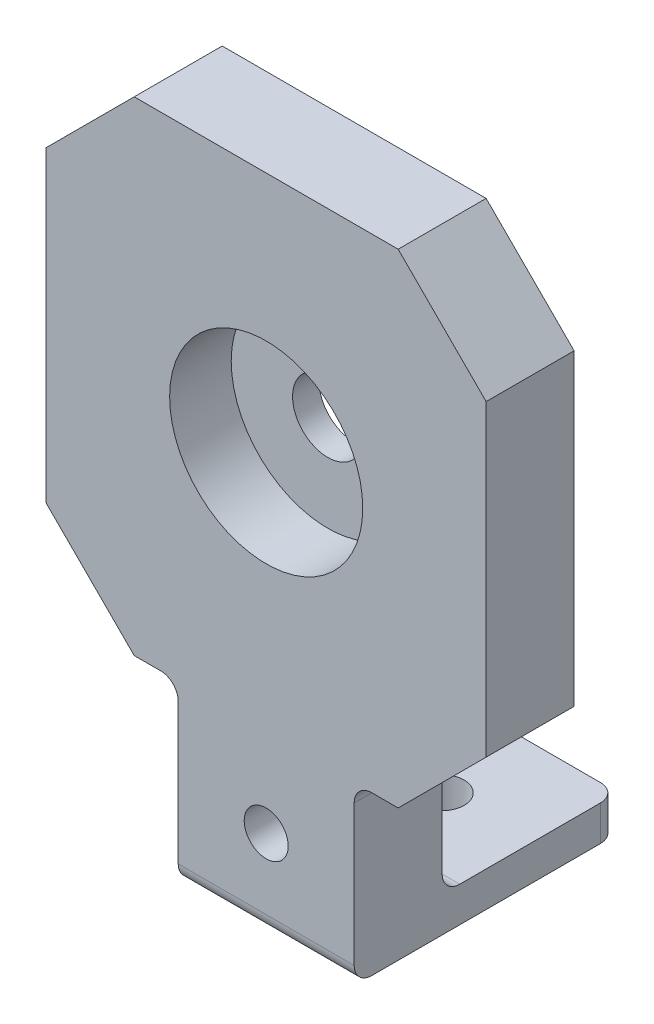
ISO-10303-21;
HEADER;
FILE_DESCRIPTION(('STEP AP214'),'2;1');
FILE_NAME('part.step','',(''),(''),'','','');
FILE_SCHEMA(('AUTOMOTIVE_DESIGN { 1 0 10303 214 1 1 1 1 }'));
ENDSEC;
DATA;
#1=APPLICATION_CONTEXT('core data for automotive mechanical design processes');
#2=APPLICATION_PROTOCOL_DEFINITION('international standard','automotive_design',2000,#1);
#3=PRODUCT_CONTEXT('',#1,'mechanical');
#4=PRODUCT('Part','Part','',(#3));
#5=PRODUCT_RELATED_PRODUCT_CATEGORY('part','',(#4));
#6=PRODUCT_DEFINITION_FORMATION('','',#4);
#7=PRODUCT_DEFINITION_CONTEXT('part definition',#1,'design');
#8=PRODUCT_DEFINITION('design','',#6,#7);
#9=PRODUCT_DEFINITION_SHAPE('','',#8);
#10=(LENGTH_UNIT() NAMED_UNIT(*) SI_UNIT(.MILLI.,.METRE.));
#11=(NAMED_UNIT(*) PLANE_ANGLE_UNIT() SI_UNIT($,.RADIAN.));
#12=(NAMED_UNIT(*) SI_UNIT($,.STERADIAN.) SOLID_ANGLE_UNIT());
#13=UNCERTAINTY_MEASURE_WITH_UNIT(LENGTH_MEASURE(1.E-05),#10,'distance_accuracy_value','');
#14=(GEOMETRIC_REPRESENTATION_CONTEXT(3) GLOBAL_UNCERTAINTY_ASSIGNED_CONTEXT((#13)) GLOBAL_UNIT_ASSIGNED_CONTEXT((#10,
#11,#12)) REPRESENTATION_CONTEXT('',''));
#15=CARTESIAN_POINT('',(0.,0.,0.));
#16=DIRECTION('',(0.,0.,1.));
#17=DIRECTION('',(1.,0.,0.));
#18=AXIS2_PLACEMENT_3D('',#15,#16,#17);
#19=CARTESIAN_POINT('',(0.,47.5,10.));
#20=DIRECTION('',(0.,0.,-1.));
#21=DIRECTION('',(-1.,0.,0.));
#22=AXIS2_PLACEMENT_3D('',#19,#20,#21);
#23=CYLINDRICAL_SURFACE('',#22,4.);
#24=CARTESIAN_POINT('',(0.,47.5,0.));
#25=DIRECTION('',(0.,0.,1.));
#26=DIRECTION('',(1.,0.,0.));
#27=AXIS2_PLACEMENT_3D('',#24,#25,#26);
#28=CIRCLE('',#27,4.);
#29=CARTESIAN_POINT('',(4.00000000000001,47.5,0.));
#30=VERTEX_POINT('',#29);
#31=EDGE_CURVE('E254',#30,#30,#28,.T.);
#32=ORIENTED_EDGE('',*,*,#31,.F.);
#33=EDGE_LOOP('',(#32));
#34=FACE_BOUND('',#33,.T.);
#35=CARTESIAN_POINT('',(0.,47.5,3.));
#36=DIRECTION('',(0.,0.,1.));
#37=DIRECTION('',(1.,0.,0.));
#38=AXIS2_PLACEMENT_3D('',#35,#36,#37);
#39=CIRCLE('',#38,4.);
#40=CARTESIAN_POINT('',(4.00000000000001,47.5,3.));
#41=VERTEX_POINT('',#40);
#42=EDGE_CURVE('E251',#41,#41,#39,.T.);
#43=ORIENTED_EDGE('',*,*,#42,.T.);
#44=EDGE_LOOP('',(#43));
#45=FACE_BOUND('',#44,.T.);
#46=ADVANCED_FACE('F35',(#34,#45),#23,.F.);
#47=CARTESIAN_POINT('',(0.,0.,10.));
#48=DIRECTION('',(0.,0.,-1.));
#49=DIRECTION('',(-1.,0.,0.));
#50=AXIS2_PLACEMENT_3D('',#47,#48,#49);
#51=PLANE('',#50);
#52=CARTESIAN_POINT('',(0.,10.,10.));
#53=DIRECTION('',(0.,0.,-1.));
#54=DIRECTION('',(-1.,0.,0.));
#55=AXIS2_PLACEMENT_3D('',#52,#53,#54);
#56=CIRCLE('',#55,2.5);
#57=CARTESIAN_POINT('',(-2.5,10.,10.));
#58=VERTEX_POINT('',#57);
#59=EDGE_CURVE('E614',#58,#58,#56,.T.);
#60=ORIENTED_EDGE('',*,*,#59,.T.);
#61=EDGE_LOOP('',(#60));
#62=FACE_BOUND('',#61,.T.);
#63=CARTESIAN_POINT('',(0.,47.5,10.));
#64=DIRECTION('',(0.,0.,1.));
#65=DIRECTION('',(1.,0.,0.));
#66=AXIS2_PLACEMENT_3D('',#63,#64,#65);
#67=CIRCLE('',#66,10.975);
#68=CARTESIAN_POINT('',(10.975,47.5,10.));
#69=VERTEX_POINT('',#68);
#70=EDGE_CURVE('E332',#69,#69,#67,.T.);
#71=ORIENTED_EDGE('',*,*,#70,.F.);
#72=EDGE_LOOP('',(#71));
#73=FACE_BOUND('',#72,.T.);
#74=DIRECTION('',(0.,-1.,0.));
#75=VECTOR('',#74,1.);
#76=CARTESIAN_POINT('',(-10.,0.,10.));
#77=LINE('',#76,#75);
#78=CARTESIAN_POINT('',(-10.,18.,10.));
#79=VERTEX_POINT('',#78);
#80=CARTESIAN_POINT('',(-10.,2.,10.));
#81=VERTEX_POINT('',#80);
#82=EDGE_CURVE('E320',#79,#81,#77,.T.);
#83=ORIENTED_EDGE('',*,*,#82,.T.);
#84=DIRECTION('',(1.,0.,0.));
#85=VECTOR('',#84,1.);
#86=CARTESIAN_POINT('',(0.,2.,10.));
#87=LINE('',#86,#85);
#88=CARTESIAN_POINT('',(10.,2.,10.));
#89=VERTEX_POINT('',#88);
#90=EDGE_CURVE('E287',#81,#89,#87,.T.);
#91=ORIENTED_EDGE('',*,*,#90,.T.);
#92=DIRECTION('',(0.,1.,0.));
#93=VECTOR('',#92,1.);
#94=CARTESIAN_POINT('',(10.,0.,10.));
#95=LINE('',#94,#93);
#96=CARTESIAN_POINT('',(10.,18.,10.));
#97=VERTEX_POINT('',#96);
#98=EDGE_CURVE('E314',#89,#97,#95,.T.);
#99=ORIENTED_EDGE('',*,*,#98,.T.);
#100=CARTESIAN_POINT('',(12.,18.,10.));
#101=DIRECTION('',(0.,0.,-1.));
#102=DIRECTION('',(-1.,0.,0.));
#103=AXIS2_PLACEMENT_3D('',#100,#101,#102);
#104=CIRCLE('',#103,2.);
#105=CARTESIAN_POINT('',(12.,20.,10.));
#106=VERTEX_POINT('',#105);
#107=EDGE_CURVE('E11',#97,#106,#104,.T.);
#108=ORIENTED_EDGE('',*,*,#107,.T.);
#109=DIRECTION('',(1.,0.,0.));
#110=VECTOR('',#109,1.);
#111=CARTESIAN_POINT('',(10.,20.,10.));
#112=LINE('',#111,#110);
#113=CARTESIAN_POINT('',(15.,20.,10.));
#114=VERTEX_POINT('',#113);
#115=EDGE_CURVE('E219',#106,#114,#112,.T.);
#116=ORIENTED_EDGE('',*,*,#115,.T.);
#117=DIRECTION('',(-0.707106781186549,-0.707106781186546,0.));
#118=VECTOR('',#117,1.);
#119=CARTESIAN_POINT('',(25.,30.,10.));
#120=LINE('',#119,#118);
#121=CARTESIAN_POINT('',(25.,30.,10.));
#122=VERTEX_POINT('',#121);
#123=EDGE_CURVE('E233',#114,#122,#120,.F.);
#124=ORIENTED_EDGE('',*,*,#123,.T.);
#125=DIRECTION('',(0.,1.,0.));
#126=VECTOR('',#125,1.);
#127=CARTESIAN_POINT('',(25.,20.,10.));
#128=LINE('',#127,#126);
#129=CARTESIAN_POINT('',(25.,65.,10.));
#130=VERTEX_POINT('',#129);
#131=EDGE_CURVE('E214',#122,#130,#128,.T.);
#132=ORIENTED_EDGE('',*,*,#131,.T.);
#133=DIRECTION('',(0.707106781186547,-0.707106781186549,0.));
#134=VECTOR('',#133,1.);
#135=CARTESIAN_POINT('',(15.,75.,10.));
#136=LINE('',#135,#134);
#137=CARTESIAN_POINT('',(15.,75.,10.));
#138=VERTEX_POINT('',#137);
#139=EDGE_CURVE('E231',#130,#138,#136,.F.);
#140=ORIENTED_EDGE('',*,*,#139,.T.);
#141=DIRECTION('',(-1.,0.,0.));
#142=VECTOR('',#141,1.);
#143=CARTESIAN_POINT('',(-25.,75.,10.));
#144=LINE('',#143,#142);
#145=CARTESIAN_POINT('',(-15.,75.,10.));
#146=VERTEX_POINT('',#145);
#147=EDGE_CURVE('E336',#138,#146,#144,.T.);
#148=ORIENTED_EDGE('',*,*,#147,.T.);
#149=DIRECTION('',(0.70710678118655,0.707106781186546,0.));
#150=VECTOR('',#149,1.);
#151=CARTESIAN_POINT('',(-25.,65.,10.));
#152=LINE('',#151,#150);
#153=CARTESIAN_POINT('',(-25.,65.,10.));
#154=VERTEX_POINT('',#153);
#155=EDGE_CURVE('E237',#146,#154,#152,.F.);
#156=ORIENTED_EDGE('',*,*,#155,.T.);
#157=DIRECTION('',(0.,-1.,0.));
#158=VECTOR('',#157,1.);
#159=CARTESIAN_POINT('',(-25.,20.,10.));
#160=LINE('',#159,#158);
#161=CARTESIAN_POINT('',(-25.,30.,10.));
#162=VERTEX_POINT('',#161);
#163=EDGE_CURVE('E191',#154,#162,#160,.T.);
#164=ORIENTED_EDGE('',*,*,#163,.T.);
#165=DIRECTION('',(-0.707106781186546,0.707106781186549,0.));
#166=VECTOR('',#165,1.);
#167=CARTESIAN_POINT('',(-15.,20.,10.));
#168=LINE('',#167,#166);
#169=CARTESIAN_POINT('',(-15.,20.,10.));
#170=VERTEX_POINT('',#169);
#171=EDGE_CURVE('E235',#162,#170,#168,.F.);
#172=ORIENTED_EDGE('',*,*,#171,.T.);
#173=DIRECTION('',(1.,0.,0.));
#174=VECTOR('',#173,1.);
#175=CARTESIAN_POINT('',(-25.,20.,10.));
#176=LINE('',#175,#174);
#177=CARTESIAN_POINT('',(-12.,20.,10.));
#178=VERTEX_POINT('',#177);
#179=EDGE_CURVE('E340',#170,#178,#176,.T.);
#180=ORIENTED_EDGE('',*,*,#179,.T.);
#181=CARTESIAN_POINT('',(-12.,18.,10.));
#182=DIRECTION('',(0.,0.,-1.));
#183=DIRECTION('',(-1.,0.,0.));
#184=AXIS2_PLACEMENT_3D('',#181,#182,#183);
#185=CIRCLE('',#184,2.);
#186=EDGE_CURVE('E301',#178,#79,#185,.T.);
#187=ORIENTED_EDGE('',*,*,#186,.T.);
#188=EDGE_LOOP('',(#83,#91,#99,#108,#116,#124,#132,#140,#148,#156,#164,#172,#180,#187));
#189=FACE_BOUND('',#188,.T.);
#190=ADVANCED_FACE('F313',(#62,#73,#189),#51,.F.);
#191=CARTESIAN_POINT('',(0.,0.,0.));
#192=DIRECTION('',(0.,0.,-1.));
#193=DIRECTION('',(-1.,0.,0.));
#194=AXIS2_PLACEMENT_3D('',#191,#192,#193);
#195=PLANE('',#194);
#196=CARTESIAN_POINT('',(0.,10.,0.));
#197=DIRECTION('',(0.,0.,-1.));
#198=DIRECTION('',(-1.,0.,0.));
#199=AXIS2_PLACEMENT_3D('',#196,#197,#198);
#200=CIRCLE('',#199,2.5);
#201=CARTESIAN_POINT('',(-2.5,10.,0.));
#202=VERTEX_POINT('',#201);
#203=EDGE_CURVE('E617',#202,#202,#200,.T.);
#204=ORIENTED_EDGE('',*,*,#203,.F.);
#205=EDGE_LOOP('',(#204));
#206=FACE_BOUND('',#205,.T.);
#207=DIRECTION('',(0.,1.,0.));
#208=VECTOR('',#207,1.);
#209=CARTESIAN_POINT('',(10.,0.,0.));
#210=LINE('',#209,#208);
#211=CARTESIAN_POINT('',(10.,6.,0.));
#212=VERTEX_POINT('',#211);
#213=CARTESIAN_POINT('',(10.,18.,0.));
#214=VERTEX_POINT('',#213);
#215=EDGE_CURVE('E209',#212,#214,#210,.T.);
#216=ORIENTED_EDGE('',*,*,#215,.F.);
#217=DIRECTION('',(1.,0.,0.));
#218=VECTOR('',#217,1.);
#219=CARTESIAN_POINT('',(0.,6.,0.));
#220=LINE('',#219,#218);
#221=CARTESIAN_POINT('',(-10.,6.,0.));
#222=VERTEX_POINT('',#221);
#223=EDGE_CURVE('E290',#212,#222,#220,.F.);
#224=ORIENTED_EDGE('',*,*,#223,.T.);
#225=DIRECTION('',(0.,-1.,0.));
#226=VECTOR('',#225,1.);
#227=CARTESIAN_POINT('',(-10.,0.,0.));
#228=LINE('',#227,#226);
#229=CARTESIAN_POINT('',(-10.,18.,0.));
#230=VERTEX_POINT('',#229);
#231=EDGE_CURVE('E201',#230,#222,#228,.T.);
#232=ORIENTED_EDGE('',*,*,#231,.F.);
#233=CARTESIAN_POINT('',(-12.,18.,0.));
#234=DIRECTION('',(0.,0.,-1.));
#235=DIRECTION('',(-1.,0.,0.));
#236=AXIS2_PLACEMENT_3D('',#233,#234,#235);
#237=CIRCLE('',#236,2.);
#238=CARTESIAN_POINT('',(-12.,20.,0.));
#239=VERTEX_POINT('',#238);
#240=EDGE_CURVE('E57',#230,#239,#237,.F.);
#241=ORIENTED_EDGE('',*,*,#240,.T.);
#242=DIRECTION('',(1.,0.,0.));
#243=VECTOR('',#242,1.);
#244=CARTESIAN_POINT('',(-25.,20.,0.));
#245=LINE('',#244,#243);
#246=CARTESIAN_POINT('',(-15.,20.,0.));
#247=VERTEX_POINT('',#246);
#248=EDGE_CURVE('E198',#247,#239,#245,.T.);
#249=ORIENTED_EDGE('',*,*,#248,.F.);
#250=DIRECTION('',(0.707106781186546,-0.707106781186549,0.));
#251=VECTOR('',#250,1.);
#252=CARTESIAN_POINT('',(2.49999999999996,2.49999999999995,0.));
#253=LINE('',#252,#251);
#254=CARTESIAN_POINT('',(-25.,30.,0.));
#255=VERTEX_POINT('',#254);
#256=EDGE_CURVE('E182',#247,#255,#253,.F.);
#257=ORIENTED_EDGE('',*,*,#256,.T.);
#258=DIRECTION('',(0.,-1.,0.));
#259=VECTOR('',#258,1.);
#260=CARTESIAN_POINT('',(-25.,20.,0.));
#261=LINE('',#260,#259);
#262=CARTESIAN_POINT('',(-25.,65.,0.));
#263=VERTEX_POINT('',#262);
#264=EDGE_CURVE('E188',#263,#255,#261,.T.);
#265=ORIENTED_EDGE('',*,*,#264,.F.);
#266=DIRECTION('',(-0.70710678118655,-0.707106781186546,0.));
#267=VECTOR('',#266,1.);
#268=CARTESIAN_POINT('',(-44.9999999999999,45.0000000000002,0.));
#269=LINE('',#268,#267);
#270=CARTESIAN_POINT('',(-15.,75.,0.));
#271=VERTEX_POINT('',#270);
#272=EDGE_CURVE('E172',#263,#271,#269,.F.);
#273=ORIENTED_EDGE('',*,*,#272,.T.);
#274=DIRECTION('',(-1.,0.,0.));
#275=VECTOR('',#274,1.);
#276=CARTESIAN_POINT('',(-25.,75.,0.));
#277=LINE('',#276,#275);
#278=CARTESIAN_POINT('',(15.,75.,0.));
#279=VERTEX_POINT('',#278);
#280=EDGE_CURVE('E199',#279,#271,#277,.T.);
#281=ORIENTED_EDGE('',*,*,#280,.F.);
#282=DIRECTION('',(-0.707106781186547,0.707106781186549,0.));
#283=VECTOR('',#282,1.);
#284=CARTESIAN_POINT('',(45.,44.9999999999999,0.));
#285=LINE('',#284,#283);
#286=CARTESIAN_POINT('',(25.,65.,0.));
#287=VERTEX_POINT('',#286);
#288=EDGE_CURVE('E192',#279,#287,#285,.F.);
#289=ORIENTED_EDGE('',*,*,#288,.T.);
#290=DIRECTION('',(0.,1.,0.));
#291=VECTOR('',#290,1.);
#292=CARTESIAN_POINT('',(25.,20.,0.));
#293=LINE('',#292,#291);
#294=CARTESIAN_POINT('',(25.,30.,0.));
#295=VERTEX_POINT('',#294);
#296=EDGE_CURVE('E203',#295,#287,#293,.T.);
#297=ORIENTED_EDGE('',*,*,#296,.F.);
#298=DIRECTION('',(0.707106781186549,0.707106781186546,0.));
#299=VECTOR('',#298,1.);
#300=CARTESIAN_POINT('',(-2.50000000000005,2.50000000000006,0.));
#301=LINE('',#300,#299);
#302=CARTESIAN_POINT('',(15.,20.,0.));
#303=VERTEX_POINT('',#302);
#304=EDGE_CURVE('E224',#295,#303,#301,.F.);
#305=ORIENTED_EDGE('',*,*,#304,.T.);
#306=DIRECTION('',(1.,0.,0.));
#307=VECTOR('',#306,1.);
#308=CARTESIAN_POINT('',(10.,20.,0.));
#309=LINE('',#308,#307);
#310=CARTESIAN_POINT('',(12.,20.,0.));
#311=VERTEX_POINT('',#310);
#312=EDGE_CURVE('E212',#311,#303,#309,.T.);
#313=ORIENTED_EDGE('',*,*,#312,.F.);
#314=CARTESIAN_POINT('',(12.,18.,0.));
#315=DIRECTION('',(0.,0.,-1.));
#316=DIRECTION('',(-1.,0.,0.));
#317=AXIS2_PLACEMENT_3D('',#314,#315,#316);
#318=CIRCLE('',#317,2.);
#319=EDGE_CURVE('E43',#311,#214,#318,.F.);
#320=ORIENTED_EDGE('',*,*,#319,.T.);
#321=EDGE_LOOP('',(#216,#224,#232,#241,#249,#257,#265,#273,#281,#289,#297,#305,#313,#320));
#322=FACE_BOUND('',#321,.T.);
#323=ORIENTED_EDGE('',*,*,#31,.T.);
#324=EDGE_LOOP('',(#323));
#325=FACE_BOUND('',#324,.T.);
#326=ADVANCED_FACE('F196',(#206,#322,#325),#195,.T.);
#327=CARTESIAN_POINT('',(25.,20.,10.));
#328=DIRECTION('',(-1.,0.,0.));
#329=DIRECTION('',(0.,0.,1.));
#330=AXIS2_PLACEMENT_3D('',#327,#328,#329);
#331=PLANE('',#330);
#332=ORIENTED_EDGE('',*,*,#131,.F.);
#333=DIRECTION('',(0.,0.,-1.));
#334=VECTOR('',#333,1.);
#335=CARTESIAN_POINT('',(25.,30.,10.));
#336=LINE('',#335,#334);
#337=EDGE_CURVE('E244',#122,#295,#336,.T.);
#338=ORIENTED_EDGE('',*,*,#337,.T.);
#339=ORIENTED_EDGE('',*,*,#296,.T.);
#340=DIRECTION('',(0.,0.,1.));
#341=VECTOR('',#340,1.);
#342=CARTESIAN_POINT('',(25.,65.,10.));
#343=LINE('',#342,#341);
#344=EDGE_CURVE('E242',#287,#130,#343,.T.);
#345=ORIENTED_EDGE('',*,*,#344,.T.);
#346=EDGE_LOOP('',(#332,#338,#339,#345));
#347=FACE_BOUND('',#346,.T.);
#348=ADVANCED_FACE('F394',(#347),#331,.F.);
#349=CARTESIAN_POINT('',(-25.,75.,10.));
#350=DIRECTION('',(0.,-1.,0.));
#351=DIRECTION('',(0.,0.,-1.));
#352=AXIS2_PLACEMENT_3D('',#349,#350,#351);
#353=PLANE('',#352);
#354=ORIENTED_EDGE('',*,*,#280,.T.);
#355=DIRECTION('',(0.,0.,1.));
#356=VECTOR('',#355,1.);
#357=CARTESIAN_POINT('',(-15.,75.,10.));
#358=LINE('',#357,#356);
#359=EDGE_CURVE('E177',#271,#146,#358,.T.);
#360=ORIENTED_EDGE('',*,*,#359,.T.);
#361=ORIENTED_EDGE('',*,*,#147,.F.);
#362=DIRECTION('',(0.,0.,-1.));
#363=VECTOR('',#362,1.);
#364=CARTESIAN_POINT('',(15.,75.,10.));
#365=LINE('',#364,#363);
#366=EDGE_CURVE('E181',#138,#279,#365,.T.);
#367=ORIENTED_EDGE('',*,*,#366,.T.);
#368=EDGE_LOOP('',(#354,#360,#361,#367));
#369=FACE_BOUND('',#368,.T.);
#370=ADVANCED_FACE('F418',(#369),#353,.F.);
#371=CARTESIAN_POINT('',(-25.,20.,10.));
#372=DIRECTION('',(1.,0.,0.));
#373=DIRECTION('',(0.,0.,-1.));
#374=AXIS2_PLACEMENT_3D('',#371,#372,#373);
#375=PLANE('',#374);
#376=ORIENTED_EDGE('',*,*,#163,.F.);
#377=DIRECTION('',(0.,0.,-1.));
#378=VECTOR('',#377,1.);
#379=CARTESIAN_POINT('',(-25.,65.,10.));
#380=LINE('',#379,#378);
#381=EDGE_CURVE('E176',#154,#263,#380,.T.);
#382=ORIENTED_EDGE('',*,*,#381,.T.);
#383=ORIENTED_EDGE('',*,*,#264,.T.);
#384=DIRECTION('',(0.,0.,1.));
#385=VECTOR('',#384,1.);
#386=CARTESIAN_POINT('',(-25.,30.,10.));
#387=LINE('',#386,#385);
#388=EDGE_CURVE('E193',#255,#162,#387,.T.);
#389=ORIENTED_EDGE('',*,*,#388,.T.);
#390=EDGE_LOOP('',(#376,#382,#383,#389));
#391=FACE_BOUND('',#390,.T.);
#392=ADVANCED_FACE('F187',(#391),#375,.F.);
#393=CARTESIAN_POINT('',(-25.,20.,10.));
#394=DIRECTION('',(0.,1.,0.));
#395=DIRECTION('',(0.,0.,1.));
#396=AXIS2_PLACEMENT_3D('',#393,#394,#395);
#397=PLANE('',#396);
#398=ORIENTED_EDGE('',*,*,#248,.T.);
#399=DIRECTION('',(0.,0.,-1.));
#400=VECTOR('',#399,1.);
#401=CARTESIAN_POINT('',(-12.,20.,10.));
#402=LINE('',#401,#400);
#403=EDGE_CURVE('E292',#239,#178,#402,.F.);
#404=ORIENTED_EDGE('',*,*,#403,.T.);
#405=ORIENTED_EDGE('',*,*,#179,.F.);
#406=DIRECTION('',(0.,0.,-1.));
#407=VECTOR('',#406,1.);
#408=CARTESIAN_POINT('',(-15.,20.,10.));
#409=LINE('',#408,#407);
#410=EDGE_CURVE('E239',#170,#247,#409,.T.);
#411=ORIENTED_EDGE('',*,*,#410,.T.);
#412=EDGE_LOOP('',(#398,#404,#405,#411));
#413=FACE_BOUND('',#412,.T.);
#414=ADVANCED_FACE('F412',(#413),#397,.F.);
#415=CARTESIAN_POINT('',(-10.,0.,10.));
#416=DIRECTION('',(1.,0.,0.));
#417=DIRECTION('',(0.,0.,-1.));
#418=AXIS2_PLACEMENT_3D('',#415,#416,#417);
#419=PLANE('',#418);
#420=DIRECTION('',(0.,0.,1.));
#421=VECTOR('',#420,1.);
#422=CARTESIAN_POINT('',(-10.,4.,-20.));
#423=LINE('',#422,#421);
#424=CARTESIAN_POINT('',(-10.,4.,-18.));
#425=VERTEX_POINT('',#424);
#426=CARTESIAN_POINT('',(-10.,4.,-2.));
#427=VERTEX_POINT('',#426);
#428=EDGE_CURVE('E372',#425,#427,#423,.T.);
#429=ORIENTED_EDGE('',*,*,#428,.F.);
#430=DIRECTION('',(0.,1.,0.));
#431=VECTOR('',#430,1.);
#432=CARTESIAN_POINT('',(-10.,0.,-18.));
#433=LINE('',#432,#431);
#434=CARTESIAN_POINT('',(-10.,0.,-18.));
#435=VERTEX_POINT('',#434);
#436=EDGE_CURVE('E273',#425,#435,#433,.F.);
#437=ORIENTED_EDGE('',*,*,#436,.T.);
#438=DIRECTION('',(0.,0.,-1.));
#439=VECTOR('',#438,1.);
#440=CARTESIAN_POINT('',(-10.,0.,10.));
#441=LINE('',#440,#439);
#442=CARTESIAN_POINT('',(-10.,0.,8.));
#443=VERTEX_POINT('',#442);
#444=EDGE_CURVE('E218',#443,#435,#441,.T.);
#445=ORIENTED_EDGE('',*,*,#444,.F.);
#446=CARTESIAN_POINT('',(-10.,2.,8.));
#447=DIRECTION('',(1.,0.,0.));
#448=DIRECTION('',(0.,0.,-1.));
#449=AXIS2_PLACEMENT_3D('',#446,#447,#448);
#450=CIRCLE('',#449,2.);
#451=EDGE_CURVE('E271',#443,#81,#450,.F.);
#452=ORIENTED_EDGE('',*,*,#451,.T.);
#453=ORIENTED_EDGE('',*,*,#82,.F.);
#454=DIRECTION('',(0.,0.,-1.));
#455=VECTOR('',#454,1.);
#456=CARTESIAN_POINT('',(-10.,18.,0.));
#457=LINE('',#456,#455);
#458=EDGE_CURVE('E268',#79,#230,#457,.T.);
#459=ORIENTED_EDGE('',*,*,#458,.T.);
#460=ORIENTED_EDGE('',*,*,#231,.T.);
#461=CARTESIAN_POINT('',(-10.,6.,-2.));
#462=DIRECTION('',(1.,0.,0.));
#463=DIRECTION('',(0.,0.,-1.));
#464=AXIS2_PLACEMENT_3D('',#461,#462,#463);
#465=CIRCLE('',#464,2.);
#466=EDGE_CURVE('E298',#222,#427,#465,.T.);
#467=ORIENTED_EDGE('',*,*,#466,.T.);
#468=EDGE_LOOP('',(#429,#437,#445,#452,#453,#459,#460,#467));
#469=FACE_BOUND('',#468,.T.);
#470=ADVANCED_FACE('F408',(#469),#419,.F.);
#471=CARTESIAN_POINT('',(-10.,0.,10.));
#472=DIRECTION('',(0.,1.,0.));
#473=DIRECTION('',(0.,0.,1.));
#474=AXIS2_PLACEMENT_3D('',#471,#472,#473);
#475=PLANE('',#474);
#476=CARTESIAN_POINT('',(0.,0.,-10.));
#477=DIRECTION('',(0.,1.,0.));
#478=DIRECTION('',(0.,0.,1.));
#479=AXIS2_PLACEMENT_3D('',#476,#477,#478);
#480=CIRCLE('',#479,2.5);
#481=CARTESIAN_POINT('',(0.,0.,-7.5));
#482=VERTEX_POINT('',#481);
#483=EDGE_CURVE('E374',#482,#482,#480,.T.);
#484=ORIENTED_EDGE('',*,*,#483,.T.);
#485=EDGE_LOOP('',(#484));
#486=FACE_BOUND('',#485,.T.);
#487=ORIENTED_EDGE('',*,*,#444,.T.);
#488=CARTESIAN_POINT('',(-8.,0.,-18.));
#489=DIRECTION('',(0.,1.,0.));
#490=DIRECTION('',(0.,0.,1.));
#491=AXIS2_PLACEMENT_3D('',#488,#489,#490);
#492=CIRCLE('',#491,2.);
#493=CARTESIAN_POINT('',(-8.,0.,-20.));
#494=VERTEX_POINT('',#493);
#495=EDGE_CURVE('E279',#435,#494,#492,.F.);
#496=ORIENTED_EDGE('',*,*,#495,.T.);
#497=DIRECTION('',(-1.,0.,0.));
#498=VECTOR('',#497,1.);
#499=CARTESIAN_POINT('',(10.,0.,-20.));
#500=LINE('',#499,#498);
#501=CARTESIAN_POINT('',(8.,0.,-20.));
#502=VERTEX_POINT('',#501);
#503=EDGE_CURVE('E358',#502,#494,#500,.T.);
#504=ORIENTED_EDGE('',*,*,#503,.F.);
#505=CARTESIAN_POINT('',(8.,0.,-18.));
#506=DIRECTION('',(0.,1.,0.));
#507=DIRECTION('',(0.,0.,1.));
#508=AXIS2_PLACEMENT_3D('',#505,#506,#507);
#509=CIRCLE('',#508,2.);
#510=CARTESIAN_POINT('',(10.,0.,-18.));
#511=VERTEX_POINT('',#510);
#512=EDGE_CURVE('E277',#502,#511,#509,.F.);
#513=ORIENTED_EDGE('',*,*,#512,.T.);
#514=DIRECTION('',(0.,0.,-1.));
#515=VECTOR('',#514,1.);
#516=CARTESIAN_POINT('',(10.,0.,10.));
#517=LINE('',#516,#515);
#518=CARTESIAN_POINT('',(10.,0.,8.));
#519=VERTEX_POINT('',#518);
#520=EDGE_CURVE('E215',#519,#511,#517,.T.);
#521=ORIENTED_EDGE('',*,*,#520,.F.);
#522=DIRECTION('',(1.,0.,0.));
#523=VECTOR('',#522,1.);
#524=CARTESIAN_POINT('',(-10.,0.,8.));
#525=LINE('',#524,#523);
#526=EDGE_CURVE('E275',#519,#443,#525,.F.);
#527=ORIENTED_EDGE('',*,*,#526,.T.);
#528=EDGE_LOOP('',(#487,#496,#504,#513,#521,#527));
#529=FACE_BOUND('',#528,.T.);
#530=ADVANCED_FACE('F354',(#486,#529),#475,.F.);
#531=CARTESIAN_POINT('',(10.,0.,10.));
#532=DIRECTION('',(-1.,0.,0.));
#533=DIRECTION('',(0.,0.,1.));
#534=AXIS2_PLACEMENT_3D('',#531,#532,#533);
#535=PLANE('',#534);
#536=ORIENTED_EDGE('',*,*,#520,.T.);
#537=DIRECTION('',(0.,-1.,0.));
#538=VECTOR('',#537,1.);
#539=CARTESIAN_POINT('',(10.,0.,-18.));
#540=LINE('',#539,#538);
#541=CARTESIAN_POINT('',(10.,4.,-18.));
#542=VERTEX_POINT('',#541);
#543=EDGE_CURVE('E285',#511,#542,#540,.F.);
#544=ORIENTED_EDGE('',*,*,#543,.T.);
#545=DIRECTION('',(0.,0.,1.));
#546=VECTOR('',#545,1.);
#547=CARTESIAN_POINT('',(10.,4.,-20.));
#548=LINE('',#547,#546);
#549=CARTESIAN_POINT('',(10.,4.,-2.));
#550=VERTEX_POINT('',#549);
#551=EDGE_CURVE('E370',#542,#550,#548,.T.);
#552=ORIENTED_EDGE('',*,*,#551,.T.);
#553=CARTESIAN_POINT('',(10.,6.,-2.));
#554=DIRECTION('',(-1.,0.,0.));
#555=DIRECTION('',(0.,0.,1.));
#556=AXIS2_PLACEMENT_3D('',#553,#554,#555);
#557=CIRCLE('',#556,2.);
#558=EDGE_CURVE('E296',#550,#212,#557,.T.);
#559=ORIENTED_EDGE('',*,*,#558,.T.);
#560=ORIENTED_EDGE('',*,*,#215,.T.);
#561=DIRECTION('',(0.,0.,-1.));
#562=VECTOR('',#561,1.);
#563=CARTESIAN_POINT('',(10.,18.,10.));
#564=LINE('',#563,#562);
#565=EDGE_CURVE('E281',#214,#97,#564,.F.);
#566=ORIENTED_EDGE('',*,*,#565,.T.);
#567=ORIENTED_EDGE('',*,*,#98,.F.);
#568=CARTESIAN_POINT('',(10.,2.,8.));
#569=DIRECTION('',(-1.,0.,0.));
#570=DIRECTION('',(0.,0.,1.));
#571=AXIS2_PLACEMENT_3D('',#568,#569,#570);
#572=CIRCLE('',#571,2.);
#573=EDGE_CURVE('E283',#89,#519,#572,.F.);
#574=ORIENTED_EDGE('',*,*,#573,.T.);
#575=EDGE_LOOP('',(#536,#544,#552,#559,#560,#566,#567,#574));
#576=FACE_BOUND('',#575,.T.);
#577=ADVANCED_FACE('F305',(#576),#535,.F.);
#578=CARTESIAN_POINT('',(10.,20.,10.));
#579=DIRECTION('',(0.,1.,0.));
#580=DIRECTION('',(-1.,0.,0.));
#581=AXIS2_PLACEMENT_3D('',#578,#579,#580);
#582=PLANE('',#581);
#583=ORIENTED_EDGE('',*,*,#115,.F.);
#584=DIRECTION('',(0.,0.,-1.));
#585=VECTOR('',#584,1.);
#586=CARTESIAN_POINT('',(12.,20.,0.));
#587=LINE('',#586,#585);
#588=EDGE_CURVE('E294',#106,#311,#587,.T.);
#589=ORIENTED_EDGE('',*,*,#588,.T.);
#590=ORIENTED_EDGE('',*,*,#312,.T.);
#591=DIRECTION('',(0.,0.,1.));
#592=VECTOR('',#591,1.);
#593=CARTESIAN_POINT('',(15.,20.,10.));
#594=LINE('',#593,#592);
#595=EDGE_CURVE('E247',#303,#114,#594,.T.);
#596=ORIENTED_EDGE('',*,*,#595,.T.);
#597=EDGE_LOOP('',(#583,#589,#590,#596));
#598=FACE_BOUND('',#597,.T.);
#599=ADVANCED_FACE('F316',(#598),#582,.F.);
#600=CARTESIAN_POINT('',(-25.,65.,10.));
#601=DIRECTION('',(0.707106781186545,-0.707106781186549,0.));
#602=DIRECTION('',(0.,0.,-1.));
#603=AXIS2_PLACEMENT_3D('',#600,#601,#602);
#604=PLANE('',#603);
#605=ORIENTED_EDGE('',*,*,#155,.F.);
#606=ORIENTED_EDGE('',*,*,#359,.F.);
#607=ORIENTED_EDGE('',*,*,#272,.F.);
#608=ORIENTED_EDGE('',*,*,#381,.F.);
#609=EDGE_LOOP('',(#605,#606,#607,#608));
#610=FACE_BOUND('',#609,.T.);
#611=ADVANCED_FACE('F175',(#610),#604,.F.);
#612=CARTESIAN_POINT('',(-15.,20.,10.));
#613=DIRECTION('',(0.707106781186549,0.707106781186546,0.));
#614=DIRECTION('',(0.,0.,-1.));
#615=AXIS2_PLACEMENT_3D('',#612,#613,#614);
#616=PLANE('',#615);
#617=ORIENTED_EDGE('',*,*,#171,.F.);
#618=ORIENTED_EDGE('',*,*,#388,.F.);
#619=ORIENTED_EDGE('',*,*,#256,.F.);
#620=ORIENTED_EDGE('',*,*,#410,.F.);
#621=EDGE_LOOP('',(#617,#618,#619,#620));
#622=FACE_BOUND('',#621,.T.);
#623=ADVANCED_FACE('F430',(#622),#616,.F.);
#624=CARTESIAN_POINT('',(25.,30.,10.));
#625=DIRECTION('',(-0.707106781186546,0.707106781186549,0.));
#626=DIRECTION('',(0.,0.,-1.));
#627=AXIS2_PLACEMENT_3D('',#624,#625,#626);
#628=PLANE('',#627);
#629=ORIENTED_EDGE('',*,*,#123,.F.);
#630=ORIENTED_EDGE('',*,*,#595,.F.);
#631=ORIENTED_EDGE('',*,*,#304,.F.);
#632=ORIENTED_EDGE('',*,*,#337,.F.);
#633=EDGE_LOOP('',(#629,#630,#631,#632));
#634=FACE_BOUND('',#633,.T.);
#635=ADVANCED_FACE('F436',(#634),#628,.F.);
#636=CARTESIAN_POINT('',(15.,75.,10.));
#637=DIRECTION('',(-0.707106781186548,-0.707106781186546,0.));
#638=DIRECTION('',(0.,0.,-1.));
#639=AXIS2_PLACEMENT_3D('',#636,#637,#638);
#640=PLANE('',#639);
#641=ORIENTED_EDGE('',*,*,#139,.F.);
#642=ORIENTED_EDGE('',*,*,#344,.F.);
#643=ORIENTED_EDGE('',*,*,#288,.F.);
#644=ORIENTED_EDGE('',*,*,#366,.F.);
#645=EDGE_LOOP('',(#641,#642,#643,#644));
#646=FACE_BOUND('',#645,.T.);
#647=ADVANCED_FACE('F443',(#646),#640,.F.);
#648=CARTESIAN_POINT('',(0.,47.5,3.));
#649=DIRECTION('',(0.,0.,1.));
#650=DIRECTION('',(1.,0.,0.));
#651=AXIS2_PLACEMENT_3D('',#648,#649,#650);
#652=CYLINDRICAL_SURFACE('',#651,10.975);
#653=CARTESIAN_POINT('',(0.,47.5,3.));
#654=DIRECTION('',(0.,0.,1.));
#655=DIRECTION('',(1.,0.,0.));
#656=AXIS2_PLACEMENT_3D('',#653,#654,#655);
#657=CIRCLE('',#656,10.975);
#658=CARTESIAN_POINT('',(10.975,47.5,3.));
#659=VERTEX_POINT('',#658);
#660=EDGE_CURVE('E255',#659,#659,#657,.T.);
#661=ORIENTED_EDGE('',*,*,#660,.F.);
#662=EDGE_LOOP('',(#661));
#663=FACE_BOUND('',#662,.T.);
#664=ORIENTED_EDGE('',*,*,#70,.T.);
#665=EDGE_LOOP('',(#664));
#666=FACE_BOUND('',#665,.T.);
#667=ADVANCED_FACE('F385',(#663,#666),#652,.F.);
#668=CARTESIAN_POINT('',(0.,47.5,3.));
#669=DIRECTION('',(0.,0.,1.));
#670=DIRECTION('',(1.,0.,0.));
#671=AXIS2_PLACEMENT_3D('',#668,#669,#670);
#672=PLANE('',#671);
#673=ORIENTED_EDGE('',*,*,#42,.F.);
#674=EDGE_LOOP('',(#673));
#675=FACE_BOUND('',#674,.T.);
#676=ORIENTED_EDGE('',*,*,#660,.T.);
#677=EDGE_LOOP('',(#676));
#678=FACE_BOUND('',#677,.T.);
#679=ADVANCED_FACE('F477',(#675,#678),#672,.T.);
#680=CARTESIAN_POINT('',(10.,4.,-20.));
#681=DIRECTION('',(0.,-1.,0.));
#682=DIRECTION('',(0.,0.,-1.));
#683=AXIS2_PLACEMENT_3D('',#680,#681,#682);
#684=PLANE('',#683);
#685=CARTESIAN_POINT('',(0.,4.,-10.));
#686=DIRECTION('',(0.,1.,0.));
#687=DIRECTION('',(0.,0.,1.));
#688=AXIS2_PLACEMENT_3D('',#685,#686,#687);
#689=CIRCLE('',#688,2.5);
#690=CARTESIAN_POINT('',(0.,4.,-7.5));
#691=VERTEX_POINT('',#690);
#692=EDGE_CURVE('E619',#691,#691,#689,.T.);
#693=ORIENTED_EDGE('',*,*,#692,.F.);
#694=EDGE_LOOP('',(#693));
#695=FACE_BOUND('',#694,.T.);
#696=DIRECTION('',(1.,0.,0.));
#697=VECTOR('',#696,1.);
#698=CARTESIAN_POINT('',(10.,4.,-20.));
#699=LINE('',#698,#697);
#700=CARTESIAN_POINT('',(-8.,4.,-20.));
#701=VERTEX_POINT('',#700);
#702=CARTESIAN_POINT('',(8.,4.,-20.));
#703=VERTEX_POINT('',#702);
#704=EDGE_CURVE('E368',#701,#703,#699,.T.);
#705=ORIENTED_EDGE('',*,*,#704,.F.);
#706=CARTESIAN_POINT('',(-8.,4.,-18.));
#707=DIRECTION('',(0.,-1.,0.));
#708=DIRECTION('',(0.,0.,-1.));
#709=AXIS2_PLACEMENT_3D('',#706,#707,#708);
#710=CIRCLE('',#709,2.);
#711=EDGE_CURVE('E266',#701,#425,#710,.F.);
#712=ORIENTED_EDGE('',*,*,#711,.T.);
#713=ORIENTED_EDGE('',*,*,#428,.T.);
#714=DIRECTION('',(1.,0.,0.));
#715=VECTOR('',#714,1.);
#716=CARTESIAN_POINT('',(10.,4.,-2.));
#717=LINE('',#716,#715);
#718=EDGE_CURVE('E261',#427,#550,#717,.T.);
#719=ORIENTED_EDGE('',*,*,#718,.T.);
#720=ORIENTED_EDGE('',*,*,#551,.F.);
#721=CARTESIAN_POINT('',(8.,4.,-18.));
#722=DIRECTION('',(0.,-1.,0.));
#723=DIRECTION('',(0.,0.,-1.));
#724=AXIS2_PLACEMENT_3D('',#721,#722,#723);
#725=CIRCLE('',#724,2.);
#726=EDGE_CURVE('E264',#542,#703,#725,.F.);
#727=ORIENTED_EDGE('',*,*,#726,.T.);
#728=EDGE_LOOP('',(#705,#712,#713,#719,#720,#727));
#729=FACE_BOUND('',#728,.T.);
#730=ADVANCED_FACE('F473',(#695,#729),#684,.F.);
#731=CARTESIAN_POINT('',(0.,0.,-20.));
#732=DIRECTION('',(0.,0.,1.));
#733=DIRECTION('',(1.,0.,0.));
#734=AXIS2_PLACEMENT_3D('',#731,#732,#733);
#735=PLANE('',#734);
#736=ORIENTED_EDGE('',*,*,#503,.T.);
#737=DIRECTION('',(0.,1.,0.));
#738=VECTOR('',#737,1.);
#739=CARTESIAN_POINT('',(-8.,0.,-20.));
#740=LINE('',#739,#738);
#741=EDGE_CURVE('E258',#494,#701,#740,.T.);
#742=ORIENTED_EDGE('',*,*,#741,.T.);
#743=ORIENTED_EDGE('',*,*,#704,.T.);
#744=DIRECTION('',(0.,-1.,0.));
#745=VECTOR('',#744,1.);
#746=CARTESIAN_POINT('',(8.,0.,-20.));
#747=LINE('',#746,#745);
#748=EDGE_CURVE('E250',#703,#502,#747,.T.);
#749=ORIENTED_EDGE('',*,*,#748,.T.);
#750=EDGE_LOOP('',(#736,#742,#743,#749));
#751=FACE_BOUND('',#750,.T.);
#752=ADVANCED_FACE('F365',(#751),#735,.F.);
#753=CARTESIAN_POINT('',(-8.,0.,-18.));
#754=DIRECTION('',(0.,1.,0.));
#755=DIRECTION('',(0.,0.,1.));
#756=AXIS2_PLACEMENT_3D('',#753,#754,#755);
#757=CYLINDRICAL_SURFACE('',#756,2.);
#758=ORIENTED_EDGE('',*,*,#495,.F.);
#759=ORIENTED_EDGE('',*,*,#436,.F.);
#760=ORIENTED_EDGE('',*,*,#711,.F.);
#761=ORIENTED_EDGE('',*,*,#741,.F.);
#762=EDGE_LOOP('',(#758,#759,#760,#761));
#763=FACE_BOUND('',#762,.T.);
#764=ADVANCED_FACE('F450',(#763),#757,.T.);
#765=CARTESIAN_POINT('',(8.,0.,-18.));
#766=DIRECTION('',(0.,-1.,0.));
#767=DIRECTION('',(0.,0.,-1.));
#768=AXIS2_PLACEMENT_3D('',#765,#766,#767);
#769=CYLINDRICAL_SURFACE('',#768,2.);
#770=ORIENTED_EDGE('',*,*,#726,.F.);
#771=ORIENTED_EDGE('',*,*,#543,.F.);
#772=ORIENTED_EDGE('',*,*,#512,.F.);
#773=ORIENTED_EDGE('',*,*,#748,.F.);
#774=EDGE_LOOP('',(#770,#771,#772,#773));
#775=FACE_BOUND('',#774,.T.);
#776=ADVANCED_FACE('F362',(#775),#769,.T.);
#777=CARTESIAN_POINT('',(0.,2.,8.));
#778=DIRECTION('',(1.,0.,0.));
#779=DIRECTION('',(0.,0.,-1.));
#780=AXIS2_PLACEMENT_3D('',#777,#778,#779);
#781=CYLINDRICAL_SURFACE('',#780,2.);
#782=ORIENTED_EDGE('',*,*,#451,.F.);
#783=ORIENTED_EDGE('',*,*,#526,.F.);
#784=ORIENTED_EDGE('',*,*,#573,.F.);
#785=ORIENTED_EDGE('',*,*,#90,.F.);
#786=EDGE_LOOP('',(#782,#783,#784,#785));
#787=FACE_BOUND('',#786,.T.);
#788=ADVANCED_FACE('F349',(#787),#781,.T.);
#789=CARTESIAN_POINT('',(10.,6.,-2.));
#790=DIRECTION('',(1.,0.,0.));
#791=DIRECTION('',(0.,0.,-1.));
#792=AXIS2_PLACEMENT_3D('',#789,#790,#791);
#793=CYLINDRICAL_SURFACE('',#792,2.);
#794=ORIENTED_EDGE('',*,*,#466,.F.);
#795=ORIENTED_EDGE('',*,*,#223,.F.);
#796=ORIENTED_EDGE('',*,*,#558,.F.);
#797=ORIENTED_EDGE('',*,*,#718,.F.);
#798=EDGE_LOOP('',(#794,#795,#796,#797));
#799=FACE_BOUND('',#798,.T.);
#800=ADVANCED_FACE('F458',(#799),#793,.F.);
#801=CARTESIAN_POINT('',(-12.,18.,10.));
#802=DIRECTION('',(0.,0.,1.));
#803=DIRECTION('',(1.,0.,0.));
#804=AXIS2_PLACEMENT_3D('',#801,#802,#803);
#805=CYLINDRICAL_SURFACE('',#804,2.);
#806=ORIENTED_EDGE('',*,*,#186,.F.);
#807=ORIENTED_EDGE('',*,*,#403,.F.);
#808=ORIENTED_EDGE('',*,*,#240,.F.);
#809=ORIENTED_EDGE('',*,*,#458,.F.);
#810=EDGE_LOOP('',(#806,#807,#808,#809));
#811=FACE_BOUND('',#810,.T.);
#812=ADVANCED_FACE('F460',(#811),#805,.F.);
#813=CARTESIAN_POINT('',(12.,18.,10.));
#814=DIRECTION('',(0.,0.,1.));
#815=DIRECTION('',(1.,0.,0.));
#816=AXIS2_PLACEMENT_3D('',#813,#814,#815);
#817=CYLINDRICAL_SURFACE('',#816,2.);
#818=ORIENTED_EDGE('',*,*,#107,.F.);
#819=ORIENTED_EDGE('',*,*,#565,.F.);
#820=ORIENTED_EDGE('',*,*,#319,.F.);
#821=ORIENTED_EDGE('',*,*,#588,.F.);
#822=EDGE_LOOP('',(#818,#819,#820,#821));
#823=FACE_BOUND('',#822,.T.);
#824=ADVANCED_FACE('F37',(#823),#817,.F.);
#825=CARTESIAN_POINT('',(0.,-16.,-10.));
#826=DIRECTION('',(0.,1.,0.));
#827=DIRECTION('',(0.,0.,1.));
#828=AXIS2_PLACEMENT_3D('',#825,#826,#827);
#829=CYLINDRICAL_SURFACE('',#828,2.5);
#830=ORIENTED_EDGE('',*,*,#692,.T.);
#831=EDGE_LOOP('',(#830));
#832=FACE_BOUND('',#831,.T.);
#833=ORIENTED_EDGE('',*,*,#483,.F.);
#834=EDGE_LOOP('',(#833));
#835=FACE_BOUND('',#834,.T.);
#836=ADVANCED_FACE('F467',(#832,#835),#829,.F.);
#837=CARTESIAN_POINT('',(0.,10.,10.));
#838=DIRECTION('',(0.,0.,-1.));
#839=DIRECTION('',(-1.,0.,0.));
#840=AXIS2_PLACEMENT_3D('',#837,#838,#839);
#841=CYLINDRICAL_SURFACE('',#840,2.5);
#842=ORIENTED_EDGE('',*,*,#59,.F.);
#843=EDGE_LOOP('',(#842));
#844=FACE_BOUND('',#843,.T.);
#845=ORIENTED_EDGE('',*,*,#203,.T.);
#846=EDGE_LOOP('',(#845));
#847=FACE_BOUND('',#846,.T.);
#848=ADVANCED_FACE('F587',(#844,#847),#841,.F.);
#849=CLOSED_SHELL('',(#46,#190,#326,#348,#370,#392,#414,#470,#530,#577,#599,#611,#623,#635,#647,
#667,#679,#730,#752,#764,#776,#788,#800,#812,#824,#836,#848));
#850=MANIFOLD_SOLID_BREP('B2',#849);
#851=ADVANCED_BREP_SHAPE_REPRESENTATION('',(#18,#850),#14);
#852=SHAPE_DEFINITION_REPRESENTATION(#9,#851);
ENDSEC;
END-ISO-10303-21;
